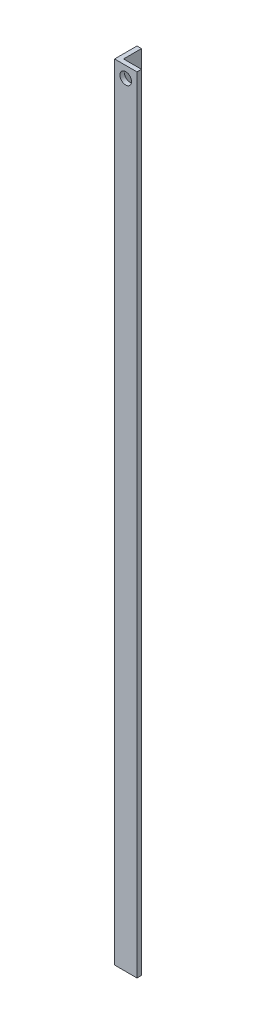
ISO-10303-21;
HEADER;
FILE_DESCRIPTION(('STEP AP214'),'2;1');
FILE_NAME('part.step','',(''),(''),'','','');
FILE_SCHEMA(('AUTOMOTIVE_DESIGN { 1 0 10303 214 1 1 1 1 }'));
ENDSEC;
DATA;
#1=APPLICATION_CONTEXT('core data for automotive mechanical design processes');
#2=APPLICATION_PROTOCOL_DEFINITION('international standard','automotive_design',2000,#1);
#3=PRODUCT_CONTEXT('',#1,'mechanical');
#4=PRODUCT('Part','Part','',(#3));
#5=PRODUCT_RELATED_PRODUCT_CATEGORY('part','',(#4));
#6=PRODUCT_DEFINITION_FORMATION('','',#4);
#7=PRODUCT_DEFINITION_CONTEXT('part definition',#1,'design');
#8=PRODUCT_DEFINITION('design','',#6,#7);
#9=PRODUCT_DEFINITION_SHAPE('','',#8);
#10=(LENGTH_UNIT() NAMED_UNIT(*) SI_UNIT(.MILLI.,.METRE.));
#11=(NAMED_UNIT(*) PLANE_ANGLE_UNIT() SI_UNIT($,.RADIAN.));
#12=(NAMED_UNIT(*) SI_UNIT($,.STERADIAN.) SOLID_ANGLE_UNIT());
#13=UNCERTAINTY_MEASURE_WITH_UNIT(LENGTH_MEASURE(1.E-05),#10,'distance_accuracy_value','');
#14=(GEOMETRIC_REPRESENTATION_CONTEXT(3) GLOBAL_UNCERTAINTY_ASSIGNED_CONTEXT((#13)) GLOBAL_UNIT_ASSIGNED_CONTEXT((#10,
#11,#12)) REPRESENTATION_CONTEXT('',''));
#15=CARTESIAN_POINT('',(0.,0.,0.));
#16=DIRECTION('',(0.,0.,1.));
#17=DIRECTION('',(1.,0.,0.));
#18=AXIS2_PLACEMENT_3D('',#15,#16,#17);
#19=CARTESIAN_POINT('',(10.,350.,0.));
#20=DIRECTION('',(0.,0.,-1.));
#21=DIRECTION('',(-1.,0.,0.));
#22=AXIS2_PLACEMENT_3D('',#19,#20,#21);
#23=PLANE('',#22);
#24=CARTESIAN_POINT('',(5.,345.,0.));
#25=DIRECTION('',(0.,0.,1.));
#26=DIRECTION('',(1.,0.,0.));
#27=AXIS2_PLACEMENT_3D('',#24,#25,#26);
#28=CIRCLE('',#27,2.59079999999999);
#29=CARTESIAN_POINT('',(7.59079999999999,345.,0.));
#30=VERTEX_POINT('',#29);
#31=EDGE_CURVE('E166',#30,#30,#28,.T.);
#32=ORIENTED_EDGE('',*,*,#31,.F.);
#33=EDGE_LOOP('',(#32));
#34=FACE_BOUND('',#33,.T.);
#35=DIRECTION('',(1.,0.,0.));
#36=VECTOR('',#35,1.);
#37=CARTESIAN_POINT('',(10.,0.,0.));
#38=LINE('',#37,#36);
#39=CARTESIAN_POINT('',(0.,0.,0.));
#40=VERTEX_POINT('',#39);
#41=CARTESIAN_POINT('',(10.,0.,0.));
#42=VERTEX_POINT('',#41);
#43=EDGE_CURVE('E122',#40,#42,#38,.T.);
#44=ORIENTED_EDGE('',*,*,#43,.T.);
#45=DIRECTION('',(0.,-1.,0.));
#46=VECTOR('',#45,1.);
#47=CARTESIAN_POINT('',(10.,350.,0.));
#48=LINE('',#47,#46);
#49=CARTESIAN_POINT('',(10.,350.,0.));
#50=VERTEX_POINT('',#49);
#51=EDGE_CURVE('E11',#50,#42,#48,.T.);
#52=ORIENTED_EDGE('',*,*,#51,.F.);
#53=DIRECTION('',(1.,0.,0.));
#54=VECTOR('',#53,1.);
#55=CARTESIAN_POINT('',(10.,350.,0.));
#56=LINE('',#55,#54);
#57=CARTESIAN_POINT('',(0.,350.,0.));
#58=VERTEX_POINT('',#57);
#59=EDGE_CURVE('E133',#58,#50,#56,.T.);
#60=ORIENTED_EDGE('',*,*,#59,.F.);
#61=DIRECTION('',(0.,-1.,0.));
#62=VECTOR('',#61,1.);
#63=CARTESIAN_POINT('',(0.,350.,0.));
#64=LINE('',#63,#62);
#65=EDGE_CURVE('E118',#58,#40,#64,.T.);
#66=ORIENTED_EDGE('',*,*,#65,.T.);
#67=EDGE_LOOP('',(#44,#52,#60,#66));
#68=FACE_BOUND('',#67,.T.);
#69=ADVANCED_FACE('F38',(#34,#68),#23,.F.);
#70=CARTESIAN_POINT('',(10.,350.,-2.));
#71=DIRECTION('',(-1.,0.,0.));
#72=DIRECTION('',(0.,0.,1.));
#73=AXIS2_PLACEMENT_3D('',#70,#71,#72);
#74=PLANE('',#73);
#75=DIRECTION('',(0.,0.,-1.));
#76=VECTOR('',#75,1.);
#77=CARTESIAN_POINT('',(10.,0.,-2.));
#78=LINE('',#77,#76);
#79=CARTESIAN_POINT('',(10.,0.,-2.));
#80=VERTEX_POINT('',#79);
#81=EDGE_CURVE('E125',#42,#80,#78,.T.);
#82=ORIENTED_EDGE('',*,*,#81,.T.);
#83=DIRECTION('',(0.,-1.,0.));
#84=VECTOR('',#83,1.);
#85=CARTESIAN_POINT('',(10.,350.,-2.));
#86=LINE('',#85,#84);
#87=CARTESIAN_POINT('',(10.,350.,-2.));
#88=VERTEX_POINT('',#87);
#89=EDGE_CURVE('E46',#88,#80,#86,.T.);
#90=ORIENTED_EDGE('',*,*,#89,.F.);
#91=DIRECTION('',(0.,0.,-1.));
#92=VECTOR('',#91,1.);
#93=CARTESIAN_POINT('',(10.,350.,-2.));
#94=LINE('',#93,#92);
#95=EDGE_CURVE('E91',#50,#88,#94,.T.);
#96=ORIENTED_EDGE('',*,*,#95,.F.);
#97=ORIENTED_EDGE('',*,*,#51,.T.);
#98=EDGE_LOOP('',(#82,#90,#96,#97));
#99=FACE_BOUND('',#98,.T.);
#100=ADVANCED_FACE('F159',(#99),#74,.F.);
#101=CARTESIAN_POINT('',(2.,350.,-2.));
#102=DIRECTION('',(0.,0.,1.));
#103=DIRECTION('',(1.,0.,0.));
#104=AXIS2_PLACEMENT_3D('',#101,#102,#103);
#105=PLANE('',#104);
#106=CARTESIAN_POINT('',(5.,345.,-2.));
#107=DIRECTION('',(0.,0.,1.));
#108=DIRECTION('',(1.,0.,0.));
#109=AXIS2_PLACEMENT_3D('',#106,#107,#108);
#110=CIRCLE('',#109,2.59079999999999);
#111=CARTESIAN_POINT('',(7.59079999999999,345.,-2.));
#112=VERTEX_POINT('',#111);
#113=EDGE_CURVE('E168',#112,#112,#110,.T.);
#114=ORIENTED_EDGE('',*,*,#113,.T.);
#115=EDGE_LOOP('',(#114));
#116=FACE_BOUND('',#115,.T.);
#117=DIRECTION('',(-1.,0.,0.));
#118=VECTOR('',#117,1.);
#119=CARTESIAN_POINT('',(2.,0.,-2.));
#120=LINE('',#119,#118);
#121=CARTESIAN_POINT('',(2.,0.,-2.));
#122=VERTEX_POINT('',#121);
#123=EDGE_CURVE('E128',#80,#122,#120,.T.);
#124=ORIENTED_EDGE('',*,*,#123,.T.);
#125=DIRECTION('',(0.,-1.,0.));
#126=VECTOR('',#125,1.);
#127=CARTESIAN_POINT('',(2.,350.,-2.));
#128=LINE('',#127,#126);
#129=CARTESIAN_POINT('',(2.,350.,-2.));
#130=VERTEX_POINT('',#129);
#131=EDGE_CURVE('E113',#130,#122,#128,.T.);
#132=ORIENTED_EDGE('',*,*,#131,.F.);
#133=DIRECTION('',(-1.,0.,0.));
#134=VECTOR('',#133,1.);
#135=CARTESIAN_POINT('',(2.,350.,-2.));
#136=LINE('',#135,#134);
#137=EDGE_CURVE('E104',#88,#130,#136,.T.);
#138=ORIENTED_EDGE('',*,*,#137,.F.);
#139=ORIENTED_EDGE('',*,*,#89,.T.);
#140=EDGE_LOOP('',(#124,#132,#138,#139));
#141=FACE_BOUND('',#140,.T.);
#142=ADVANCED_FACE('F139',(#116,#141),#105,.F.);
#143=CARTESIAN_POINT('',(2.,350.,-10.));
#144=DIRECTION('',(-1.,0.,0.));
#145=DIRECTION('',(0.,0.,1.));
#146=AXIS2_PLACEMENT_3D('',#143,#144,#145);
#147=PLANE('',#146);
#148=CARTESIAN_POINT('',(2.,5.,-5.));
#149=DIRECTION('',(-1.,0.,0.));
#150=DIRECTION('',(0.,0.,1.));
#151=AXIS2_PLACEMENT_3D('',#148,#149,#150);
#152=CIRCLE('',#151,2.59079999999999);
#153=CARTESIAN_POINT('',(2.,5.,-2.40920000000001));
#154=VERTEX_POINT('',#153);
#155=EDGE_CURVE('E126',#154,#154,#152,.T.);
#156=ORIENTED_EDGE('',*,*,#155,.T.);
#157=EDGE_LOOP('',(#156));
#158=FACE_BOUND('',#157,.T.);
#159=DIRECTION('',(0.,0.,-1.));
#160=VECTOR('',#159,1.);
#161=CARTESIAN_POINT('',(2.,0.,-10.));
#162=LINE('',#161,#160);
#163=CARTESIAN_POINT('',(2.,0.,-10.));
#164=VERTEX_POINT('',#163);
#165=EDGE_CURVE('E112',#122,#164,#162,.T.);
#166=ORIENTED_EDGE('',*,*,#165,.T.);
#167=DIRECTION('',(0.,-1.,0.));
#168=VECTOR('',#167,1.);
#169=CARTESIAN_POINT('',(2.,350.,-10.));
#170=LINE('',#169,#168);
#171=CARTESIAN_POINT('',(2.,350.,-10.));
#172=VERTEX_POINT('',#171);
#173=EDGE_CURVE('E109',#172,#164,#170,.T.);
#174=ORIENTED_EDGE('',*,*,#173,.F.);
#175=DIRECTION('',(0.,0.,-1.));
#176=VECTOR('',#175,1.);
#177=CARTESIAN_POINT('',(2.,350.,-10.));
#178=LINE('',#177,#176);
#179=EDGE_CURVE('E98',#130,#172,#178,.T.);
#180=ORIENTED_EDGE('',*,*,#179,.F.);
#181=ORIENTED_EDGE('',*,*,#131,.T.);
#182=EDGE_LOOP('',(#166,#174,#180,#181));
#183=FACE_BOUND('',#182,.T.);
#184=ADVANCED_FACE('F110',(#158,#183),#147,.F.);
#185=CARTESIAN_POINT('',(0.,350.,-10.));
#186=DIRECTION('',(0.,0.,1.));
#187=DIRECTION('',(1.,0.,0.));
#188=AXIS2_PLACEMENT_3D('',#185,#186,#187);
#189=PLANE('',#188);
#190=DIRECTION('',(-1.,0.,0.));
#191=VECTOR('',#190,1.);
#192=CARTESIAN_POINT('',(0.,0.,-10.));
#193=LINE('',#192,#191);
#194=CARTESIAN_POINT('',(0.,0.,-10.));
#195=VERTEX_POINT('',#194);
#196=EDGE_CURVE('E77',#164,#195,#193,.T.);
#197=ORIENTED_EDGE('',*,*,#196,.T.);
#198=DIRECTION('',(0.,-1.,0.));
#199=VECTOR('',#198,1.);
#200=CARTESIAN_POINT('',(0.,350.,-10.));
#201=LINE('',#200,#199);
#202=CARTESIAN_POINT('',(0.,350.,-10.));
#203=VERTEX_POINT('',#202);
#204=EDGE_CURVE('E114',#203,#195,#201,.T.);
#205=ORIENTED_EDGE('',*,*,#204,.F.);
#206=DIRECTION('',(-1.,0.,0.));
#207=VECTOR('',#206,1.);
#208=CARTESIAN_POINT('',(0.,350.,-10.));
#209=LINE('',#208,#207);
#210=EDGE_CURVE('E102',#172,#203,#209,.T.);
#211=ORIENTED_EDGE('',*,*,#210,.F.);
#212=ORIENTED_EDGE('',*,*,#173,.T.);
#213=EDGE_LOOP('',(#197,#205,#211,#212));
#214=FACE_BOUND('',#213,.T.);
#215=ADVANCED_FACE('F116',(#214),#189,.F.);
#216=CARTESIAN_POINT('',(0.,350.,0.));
#217=DIRECTION('',(1.,0.,0.));
#218=DIRECTION('',(0.,0.,-1.));
#219=AXIS2_PLACEMENT_3D('',#216,#217,#218);
#220=PLANE('',#219);
#221=CARTESIAN_POINT('',(0.,5.,-5.));
#222=DIRECTION('',(-1.,0.,0.));
#223=DIRECTION('',(0.,0.,1.));
#224=AXIS2_PLACEMENT_3D('',#221,#222,#223);
#225=CIRCLE('',#224,2.59079999999999);
#226=CARTESIAN_POINT('',(0.,5.,-2.40920000000001));
#227=VERTEX_POINT('',#226);
#228=EDGE_CURVE('E171',#227,#227,#225,.T.);
#229=ORIENTED_EDGE('',*,*,#228,.F.);
#230=EDGE_LOOP('',(#229));
#231=FACE_BOUND('',#230,.T.);
#232=DIRECTION('',(0.,0.,1.));
#233=VECTOR('',#232,1.);
#234=CARTESIAN_POINT('',(0.,0.,0.));
#235=LINE('',#234,#233);
#236=EDGE_CURVE('E83',#195,#40,#235,.T.);
#237=ORIENTED_EDGE('',*,*,#236,.T.);
#238=ORIENTED_EDGE('',*,*,#65,.F.);
#239=DIRECTION('',(0.,0.,1.));
#240=VECTOR('',#239,1.);
#241=CARTESIAN_POINT('',(0.,350.,0.));
#242=LINE('',#241,#240);
#243=EDGE_CURVE('E54',#203,#58,#242,.T.);
#244=ORIENTED_EDGE('',*,*,#243,.F.);
#245=ORIENTED_EDGE('',*,*,#204,.T.);
#246=EDGE_LOOP('',(#237,#238,#244,#245));
#247=FACE_BOUND('',#246,.T.);
#248=ADVANCED_FACE('F146',(#231,#247),#220,.F.);
#249=CARTESIAN_POINT('',(0.,350.,0.));
#250=DIRECTION('',(0.,-1.,0.));
#251=DIRECTION('',(0.,0.,-1.));
#252=AXIS2_PLACEMENT_3D('',#249,#250,#251);
#253=PLANE('',#252);
#254=ORIENTED_EDGE('',*,*,#59,.T.);
#255=ORIENTED_EDGE('',*,*,#95,.T.);
#256=ORIENTED_EDGE('',*,*,#137,.T.);
#257=ORIENTED_EDGE('',*,*,#179,.T.);
#258=ORIENTED_EDGE('',*,*,#210,.T.);
#259=ORIENTED_EDGE('',*,*,#243,.T.);
#260=EDGE_LOOP('',(#254,#255,#256,#257,#258,#259));
#261=FACE_BOUND('',#260,.T.);
#262=ADVANCED_FACE('F100',(#261),#253,.F.);
#263=CARTESIAN_POINT('',(0.,0.,0.));
#264=DIRECTION('',(0.,-1.,0.));
#265=DIRECTION('',(0.,0.,-1.));
#266=AXIS2_PLACEMENT_3D('',#263,#264,#265);
#267=PLANE('',#266);
#268=ORIENTED_EDGE('',*,*,#43,.F.);
#269=ORIENTED_EDGE('',*,*,#236,.F.);
#270=ORIENTED_EDGE('',*,*,#196,.F.);
#271=ORIENTED_EDGE('',*,*,#165,.F.);
#272=ORIENTED_EDGE('',*,*,#123,.F.);
#273=ORIENTED_EDGE('',*,*,#81,.F.);
#274=EDGE_LOOP('',(#268,#269,#270,#271,#272,#273));
#275=FACE_BOUND('',#274,.T.);
#276=ADVANCED_FACE('F142',(#275),#267,.T.);
#277=CARTESIAN_POINT('',(0.,5.,-5.));
#278=DIRECTION('',(-1.,0.,0.));
#279=DIRECTION('',(0.,0.,1.));
#280=AXIS2_PLACEMENT_3D('',#277,#278,#279);
#281=CYLINDRICAL_SURFACE('',#280,2.59079999999999);
#282=ORIENTED_EDGE('',*,*,#228,.T.);
#283=EDGE_LOOP('',(#282));
#284=FACE_BOUND('',#283,.T.);
#285=ORIENTED_EDGE('',*,*,#155,.F.);
#286=EDGE_LOOP('',(#285));
#287=FACE_BOUND('',#286,.T.);
#288=ADVANCED_FACE('F182',(#284,#287),#281,.F.);
#289=CARTESIAN_POINT('',(5.,345.,0.));
#290=DIRECTION('',(0.,0.,1.));
#291=DIRECTION('',(1.,0.,0.));
#292=AXIS2_PLACEMENT_3D('',#289,#290,#291);
#293=CYLINDRICAL_SURFACE('',#292,2.59079999999999);
#294=ORIENTED_EDGE('',*,*,#31,.T.);
#295=EDGE_LOOP('',(#294));
#296=FACE_BOUND('',#295,.T.);
#297=ORIENTED_EDGE('',*,*,#113,.F.);
#298=EDGE_LOOP('',(#297));
#299=FACE_BOUND('',#298,.T.);
#300=ADVANCED_FACE('F184',(#296,#299),#293,.F.);
#301=CLOSED_SHELL('',(#69,#100,#142,#184,#215,#248,#262,#276,#288,#300));
#302=MANIFOLD_SOLID_BREP('B2',#301);
#303=ADVANCED_BREP_SHAPE_REPRESENTATION('',(#18,#302),#14);
#304=SHAPE_DEFINITION_REPRESENTATION(#9,#303);
ENDSEC;
END-ISO-10303-21;
